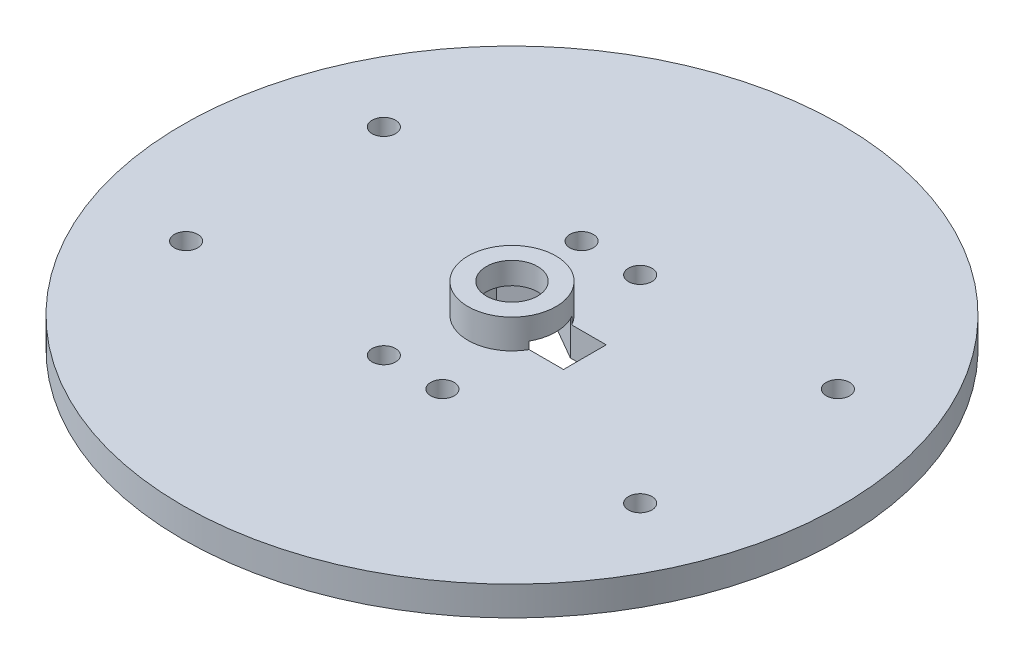
ISO-10303-21;
HEADER;
FILE_DESCRIPTION(('STEP AP214'),'2;1');
FILE_NAME('part.step','',(''),(''),'','','');
FILE_SCHEMA(('AUTOMOTIVE_DESIGN { 1 0 10303 214 1 1 1 1 }'));
ENDSEC;
DATA;
#1=APPLICATION_CONTEXT('core data for automotive mechanical design processes');
#2=APPLICATION_PROTOCOL_DEFINITION('international standard','automotive_design',2000,#1);
#3=PRODUCT_CONTEXT('',#1,'mechanical');
#4=PRODUCT('Part','Part','',(#3));
#5=PRODUCT_RELATED_PRODUCT_CATEGORY('part','',(#4));
#6=PRODUCT_DEFINITION_FORMATION('','',#4);
#7=PRODUCT_DEFINITION_CONTEXT('part definition',#1,'design');
#8=PRODUCT_DEFINITION('design','',#6,#7);
#9=PRODUCT_DEFINITION_SHAPE('','',#8);
#10=(LENGTH_UNIT() NAMED_UNIT(*) SI_UNIT(.MILLI.,.METRE.));
#11=(NAMED_UNIT(*) PLANE_ANGLE_UNIT() SI_UNIT($,.RADIAN.));
#12=(NAMED_UNIT(*) SI_UNIT($,.STERADIAN.) SOLID_ANGLE_UNIT());
#13=UNCERTAINTY_MEASURE_WITH_UNIT(LENGTH_MEASURE(1.E-05),#10,'distance_accuracy_value','');
#14=(GEOMETRIC_REPRESENTATION_CONTEXT(3) GLOBAL_UNCERTAINTY_ASSIGNED_CONTEXT((#13)) GLOBAL_UNIT_ASSIGNED_CONTEXT((#10,
#11,#12)) REPRESENTATION_CONTEXT('',''));
#15=CARTESIAN_POINT('',(0.,0.,0.));
#16=DIRECTION('',(0.,0.,1.));
#17=DIRECTION('',(1.,0.,0.));
#18=AXIS2_PLACEMENT_3D('',#15,#16,#17);
#19=CARTESIAN_POINT('',(0.,4.,0.));
#20=DIRECTION('',(0.,-1.,0.));
#21=DIRECTION('',(0.,0.,-1.));
#22=AXIS2_PLACEMENT_3D('',#19,#20,#21);
#23=CYLINDRICAL_SURFACE('',#22,45.);
#24=CARTESIAN_POINT('',(0.,4.,0.));
#25=DIRECTION('',(0.,1.,0.));
#26=DIRECTION('',(0.,0.,1.));
#27=AXIS2_PLACEMENT_3D('',#24,#25,#26);
#28=CIRCLE('',#27,45.);
#29=CARTESIAN_POINT('',(0.,4.,45.));
#30=VERTEX_POINT('',#29);
#31=EDGE_CURVE('E271',#30,#30,#28,.T.);
#32=ORIENTED_EDGE('',*,*,#31,.F.);
#33=EDGE_LOOP('',(#32));
#34=FACE_BOUND('',#33,.T.);
#35=CARTESIAN_POINT('',(0.,0.,0.));
#36=DIRECTION('',(0.,1.,0.));
#37=DIRECTION('',(0.,0.,1.));
#38=AXIS2_PLACEMENT_3D('',#35,#36,#37);
#39=CIRCLE('',#38,45.);
#40=CARTESIAN_POINT('',(0.,0.,45.));
#41=VERTEX_POINT('',#40);
#42=EDGE_CURVE('E267',#41,#41,#39,.T.);
#43=ORIENTED_EDGE('',*,*,#42,.T.);
#44=EDGE_LOOP('',(#43));
#45=FACE_BOUND('',#44,.T.);
#46=ADVANCED_FACE('F52',(#34,#45),#23,.T.);
#47=CARTESIAN_POINT('',(0.,4.,0.));
#48=DIRECTION('',(0.,1.,0.));
#49=DIRECTION('',(0.,0.,1.));
#50=AXIS2_PLACEMENT_3D('',#47,#48,#49);
#51=PLANE('',#50);
#52=CARTESIAN_POINT('',(-31.,4.,13.5));
#53=DIRECTION('',(0.,1.,0.));
#54=DIRECTION('',(0.,0.,1.));
#55=AXIS2_PLACEMENT_3D('',#52,#53,#54);
#56=CIRCLE('',#55,1.6);
#57=CARTESIAN_POINT('',(-31.,4.,15.1));
#58=VERTEX_POINT('',#57);
#59=EDGE_CURVE('E563',#58,#58,#56,.T.);
#60=ORIENTED_EDGE('',*,*,#59,.F.);
#61=EDGE_LOOP('',(#60));
#62=FACE_BOUND('',#61,.T.);
#63=CARTESIAN_POINT('',(31.,4.,-13.5));
#64=DIRECTION('',(0.,1.,0.));
#65=DIRECTION('',(0.,0.,1.));
#66=AXIS2_PLACEMENT_3D('',#63,#64,#65);
#67=CIRCLE('',#66,1.6);
#68=CARTESIAN_POINT('',(31.,4.,-11.9));
#69=VERTEX_POINT('',#68);
#70=EDGE_CURVE('E568',#69,#69,#67,.T.);
#71=ORIENTED_EDGE('',*,*,#70,.F.);
#72=EDGE_LOOP('',(#71));
#73=FACE_BOUND('',#72,.T.);
#74=CARTESIAN_POINT('',(31.,4.,13.5));
#75=DIRECTION('',(0.,1.,0.));
#76=DIRECTION('',(0.,0.,1.));
#77=AXIS2_PLACEMENT_3D('',#74,#75,#76);
#78=CIRCLE('',#77,1.6);
#79=CARTESIAN_POINT('',(31.,4.,15.1));
#80=VERTEX_POINT('',#79);
#81=EDGE_CURVE('E574',#80,#80,#78,.T.);
#82=ORIENTED_EDGE('',*,*,#81,.F.);
#83=EDGE_LOOP('',(#82));
#84=FACE_BOUND('',#83,.T.);
#85=CARTESIAN_POINT('',(-31.,4.,-13.5));
#86=DIRECTION('',(0.,1.,0.));
#87=DIRECTION('',(0.,0.,1.));
#88=AXIS2_PLACEMENT_3D('',#85,#86,#87);
#89=CIRCLE('',#88,1.6);
#90=CARTESIAN_POINT('',(-31.,4.,-11.9));
#91=VERTEX_POINT('',#90);
#92=EDGE_CURVE('E578',#91,#91,#89,.T.);
#93=ORIENTED_EDGE('',*,*,#92,.F.);
#94=EDGE_LOOP('',(#93));
#95=FACE_BOUND('',#94,.T.);
#96=DIRECTION('',(1.,0.,0.));
#97=VECTOR('',#96,1.);
#98=CARTESIAN_POINT('',(0.,4.,2.91561885940761));
#99=LINE('',#98,#97);
#100=CARTESIAN_POINT('',(5.24396478503305,4.,2.91561885940761));
#101=VERTEX_POINT('',#100);
#102=CARTESIAN_POINT('',(9.95,4.,2.91561885940761));
#103=VERTEX_POINT('',#102);
#104=EDGE_CURVE('E224',#101,#103,#99,.T.);
#105=ORIENTED_EDGE('',*,*,#104,.F.);
#106=CARTESIAN_POINT('',(0.,4.,0.));
#107=DIRECTION('',(0.,1.,0.));
#108=DIRECTION('',(0.,0.,1.));
#109=AXIS2_PLACEMENT_3D('',#106,#107,#108);
#110=CIRCLE('',#109,6.);
#111=CARTESIAN_POINT('',(5.24396478503305,4.,-2.91561885940761));
#112=VERTEX_POINT('',#111);
#113=EDGE_CURVE('E259',#112,#101,#110,.T.);
#114=ORIENTED_EDGE('',*,*,#113,.F.);
#115=DIRECTION('',(-1.,0.,0.));
#116=VECTOR('',#115,1.);
#117=CARTESIAN_POINT('',(0.,4.,-2.9156188594076));
#118=LINE('',#117,#116);
#119=CARTESIAN_POINT('',(9.95,4.,-2.91561885940761));
#120=VERTEX_POINT('',#119);
#121=EDGE_CURVE('E204',#120,#112,#118,.T.);
#122=ORIENTED_EDGE('',*,*,#121,.F.);
#123=DIRECTION('',(0.,0.,-1.));
#124=VECTOR('',#123,1.);
#125=CARTESIAN_POINT('',(9.95,4.,0.));
#126=LINE('',#125,#124);
#127=EDGE_CURVE('E227',#103,#120,#126,.T.);
#128=ORIENTED_EDGE('',*,*,#127,.F.);
#129=EDGE_LOOP('',(#105,#114,#122,#128));
#130=FACE_BOUND('',#129,.T.);
#131=CARTESIAN_POINT('',(4.,4.,-13.5));
#132=DIRECTION('',(0.,1.,0.));
#133=DIRECTION('',(0.,0.,1.));
#134=AXIS2_PLACEMENT_3D('',#131,#132,#133);
#135=CIRCLE('',#134,1.6);
#136=CARTESIAN_POINT('',(4.,4.,-11.9));
#137=VERTEX_POINT('',#136);
#138=EDGE_CURVE('E230',#137,#137,#135,.T.);
#139=ORIENTED_EDGE('',*,*,#138,.F.);
#140=EDGE_LOOP('',(#139));
#141=FACE_BOUND('',#140,.T.);
#142=CARTESIAN_POINT('',(4.,4.,13.5));
#143=DIRECTION('',(0.,1.,0.));
#144=DIRECTION('',(0.,0.,1.));
#145=AXIS2_PLACEMENT_3D('',#142,#143,#144);
#146=CIRCLE('',#145,1.6);
#147=CARTESIAN_POINT('',(4.,4.,15.1));
#148=VERTEX_POINT('',#147);
#149=EDGE_CURVE('E244',#148,#148,#146,.T.);
#150=ORIENTED_EDGE('',*,*,#149,.F.);
#151=EDGE_LOOP('',(#150));
#152=FACE_BOUND('',#151,.T.);
#153=CARTESIAN_POINT('',(-4.,4.,13.5));
#154=DIRECTION('',(0.,1.,0.));
#155=DIRECTION('',(0.,0.,1.));
#156=AXIS2_PLACEMENT_3D('',#153,#154,#155);
#157=CIRCLE('',#156,1.6);
#158=CARTESIAN_POINT('',(-4.,4.,15.1));
#159=VERTEX_POINT('',#158);
#160=EDGE_CURVE('E236',#159,#159,#157,.T.);
#161=ORIENTED_EDGE('',*,*,#160,.F.);
#162=EDGE_LOOP('',(#161));
#163=FACE_BOUND('',#162,.T.);
#164=CARTESIAN_POINT('',(-4.,4.,-13.5));
#165=DIRECTION('',(0.,1.,0.));
#166=DIRECTION('',(0.,0.,1.));
#167=AXIS2_PLACEMENT_3D('',#164,#165,#166);
#168=CIRCLE('',#167,1.6);
#169=CARTESIAN_POINT('',(-4.,4.,-11.9));
#170=VERTEX_POINT('',#169);
#171=EDGE_CURVE('E235',#170,#170,#168,.T.);
#172=ORIENTED_EDGE('',*,*,#171,.F.);
#173=EDGE_LOOP('',(#172));
#174=FACE_BOUND('',#173,.T.);
#175=ORIENTED_EDGE('',*,*,#31,.T.);
#176=EDGE_LOOP('',(#175));
#177=FACE_BOUND('',#176,.T.);
#178=ADVANCED_FACE('F289',(#62,#73,#84,#95,#130,#141,#152,#163,#174,#177),#51,.T.);
#179=CARTESIAN_POINT('',(0.,0.,0.));
#180=DIRECTION('',(0.,1.,0.));
#181=DIRECTION('',(0.,0.,1.));
#182=AXIS2_PLACEMENT_3D('',#179,#180,#181);
#183=PLANE('',#182);
#184=CARTESIAN_POINT('',(-31.,0.,13.5));
#185=DIRECTION('',(0.,-1.,0.));
#186=DIRECTION('',(0.,0.,1.));
#187=AXIS2_PLACEMENT_3D('',#184,#185,#186);
#188=CIRCLE('',#187,1.6);
#189=CARTESIAN_POINT('',(-31.,0.,15.1));
#190=VERTEX_POINT('',#189);
#191=EDGE_CURVE('E587',#190,#190,#188,.T.);
#192=ORIENTED_EDGE('',*,*,#191,.F.);
#193=EDGE_LOOP('',(#192));
#194=FACE_BOUND('',#193,.T.);
#195=CARTESIAN_POINT('',(31.,0.,-13.5));
#196=DIRECTION('',(0.,-1.,0.));
#197=DIRECTION('',(0.,0.,-1.));
#198=AXIS2_PLACEMENT_3D('',#195,#196,#197);
#199=CIRCLE('',#198,1.6);
#200=CARTESIAN_POINT('',(31.,0.,-15.1));
#201=VERTEX_POINT('',#200);
#202=EDGE_CURVE('E586',#201,#201,#199,.T.);
#203=ORIENTED_EDGE('',*,*,#202,.F.);
#204=EDGE_LOOP('',(#203));
#205=FACE_BOUND('',#204,.T.);
#206=CARTESIAN_POINT('',(31.,0.,13.5));
#207=DIRECTION('',(0.,-1.,0.));
#208=DIRECTION('',(0.,0.,-1.));
#209=AXIS2_PLACEMENT_3D('',#206,#207,#208);
#210=CIRCLE('',#209,1.6);
#211=CARTESIAN_POINT('',(31.,0.,11.9));
#212=VERTEX_POINT('',#211);
#213=EDGE_CURVE('E582',#212,#212,#210,.T.);
#214=ORIENTED_EDGE('',*,*,#213,.F.);
#215=EDGE_LOOP('',(#214));
#216=FACE_BOUND('',#215,.T.);
#217=CARTESIAN_POINT('',(-31.,0.,-13.5));
#218=DIRECTION('',(0.,-1.,0.));
#219=DIRECTION('',(0.,0.,1.));
#220=AXIS2_PLACEMENT_3D('',#217,#218,#219);
#221=CIRCLE('',#220,1.6);
#222=CARTESIAN_POINT('',(-31.,0.,-11.9));
#223=VERTEX_POINT('',#222);
#224=EDGE_CURVE('E591',#223,#223,#221,.T.);
#225=ORIENTED_EDGE('',*,*,#224,.F.);
#226=EDGE_LOOP('',(#225));
#227=FACE_BOUND('',#226,.T.);
#228=DIRECTION('',(-0.866025403784439,0.,0.5));
#229=VECTOR('',#228,1.);
#230=CARTESIAN_POINT('',(5.05,0.,2.91561885940761));
#231=LINE('',#230,#229);
#232=CARTESIAN_POINT('',(5.05,0.,2.91561885940761));
#233=VERTEX_POINT('',#232);
#234=CARTESIAN_POINT('',(0.,0.,5.83123771881522));
#235=VERTEX_POINT('',#234);
#236=EDGE_CURVE('E174',#233,#235,#231,.T.);
#237=ORIENTED_EDGE('',*,*,#236,.F.);
#238=DIRECTION('',(-1.,0.,0.));
#239=VECTOR('',#238,1.);
#240=CARTESIAN_POINT('',(9.95,0.,2.91561885940761));
#241=LINE('',#240,#239);
#242=CARTESIAN_POINT('',(9.95,0.,2.91561885940761));
#243=VERTEX_POINT('',#242);
#244=EDGE_CURVE('E67',#243,#233,#241,.T.);
#245=ORIENTED_EDGE('',*,*,#244,.F.);
#246=DIRECTION('',(0.,0.,1.));
#247=VECTOR('',#246,1.);
#248=CARTESIAN_POINT('',(9.95,0.,2.91561885940761));
#249=LINE('',#248,#247);
#250=CARTESIAN_POINT('',(9.95,0.,-2.91561885940761));
#251=VERTEX_POINT('',#250);
#252=EDGE_CURVE('E138',#251,#243,#249,.T.);
#253=ORIENTED_EDGE('',*,*,#252,.F.);
#254=DIRECTION('',(1.,0.,0.));
#255=VECTOR('',#254,1.);
#256=CARTESIAN_POINT('',(9.95,0.,-2.91561885940761));
#257=LINE('',#256,#255);
#258=CARTESIAN_POINT('',(5.05,0.,-2.91561885940761));
#259=VERTEX_POINT('',#258);
#260=EDGE_CURVE('E194',#259,#251,#257,.T.);
#261=ORIENTED_EDGE('',*,*,#260,.F.);
#262=DIRECTION('',(0.866025403784438,0.,0.5));
#263=VECTOR('',#262,1.);
#264=CARTESIAN_POINT('',(0.,0.,-5.83123771881522));
#265=LINE('',#264,#263);
#266=CARTESIAN_POINT('',(0.,0.,-5.83123771881522));
#267=VERTEX_POINT('',#266);
#268=EDGE_CURVE('E190',#267,#259,#265,.T.);
#269=ORIENTED_EDGE('',*,*,#268,.F.);
#270=DIRECTION('',(0.866025403784439,0.,-0.5));
#271=VECTOR('',#270,1.);
#272=CARTESIAN_POINT('',(-5.05,0.,-2.91561885940761));
#273=LINE('',#272,#271);
#274=CARTESIAN_POINT('',(-5.05,0.,-2.91561885940761));
#275=VERTEX_POINT('',#274);
#276=EDGE_CURVE('E186',#275,#267,#273,.T.);
#277=ORIENTED_EDGE('',*,*,#276,.F.);
#278=DIRECTION('',(0.,0.,-1.));
#279=VECTOR('',#278,1.);
#280=CARTESIAN_POINT('',(-5.05,0.,2.91561885940761));
#281=LINE('',#280,#279);
#282=CARTESIAN_POINT('',(-5.05,0.,2.91561885940761));
#283=VERTEX_POINT('',#282);
#284=EDGE_CURVE('E182',#283,#275,#281,.T.);
#285=ORIENTED_EDGE('',*,*,#284,.F.);
#286=DIRECTION('',(-0.866025403784439,0.,-0.5));
#287=VECTOR('',#286,1.);
#288=CARTESIAN_POINT('',(0.,0.,5.83123771881522));
#289=LINE('',#288,#287);
#290=EDGE_CURVE('E178',#235,#283,#289,.T.);
#291=ORIENTED_EDGE('',*,*,#290,.F.);
#292=EDGE_LOOP('',(#237,#245,#253,#261,#269,#277,#285,#291));
#293=FACE_BOUND('',#292,.T.);
#294=CARTESIAN_POINT('',(4.,0.,-13.5));
#295=DIRECTION('',(0.,1.,0.));
#296=DIRECTION('',(0.,0.,1.));
#297=AXIS2_PLACEMENT_3D('',#294,#295,#296);
#298=CIRCLE('',#297,1.6);
#299=CARTESIAN_POINT('',(4.,0.,-11.9));
#300=VERTEX_POINT('',#299);
#301=EDGE_CURVE('E248',#300,#300,#298,.T.);
#302=ORIENTED_EDGE('',*,*,#301,.T.);
#303=EDGE_LOOP('',(#302));
#304=FACE_BOUND('',#303,.T.);
#305=CARTESIAN_POINT('',(4.,0.,13.5));
#306=DIRECTION('',(0.,1.,0.));
#307=DIRECTION('',(0.,0.,1.));
#308=AXIS2_PLACEMENT_3D('',#305,#306,#307);
#309=CIRCLE('',#308,1.6);
#310=CARTESIAN_POINT('',(4.,0.,15.1));
#311=VERTEX_POINT('',#310);
#312=EDGE_CURVE('E240',#311,#311,#309,.T.);
#313=ORIENTED_EDGE('',*,*,#312,.T.);
#314=EDGE_LOOP('',(#313));
#315=FACE_BOUND('',#314,.T.);
#316=CARTESIAN_POINT('',(-4.,0.,13.5));
#317=DIRECTION('',(0.,1.,0.));
#318=DIRECTION('',(0.,0.,1.));
#319=AXIS2_PLACEMENT_3D('',#316,#317,#318);
#320=CIRCLE('',#319,1.6);
#321=CARTESIAN_POINT('',(-4.,0.,15.1));
#322=VERTEX_POINT('',#321);
#323=EDGE_CURVE('E231',#322,#322,#320,.T.);
#324=ORIENTED_EDGE('',*,*,#323,.T.);
#325=EDGE_LOOP('',(#324));
#326=FACE_BOUND('',#325,.T.);
#327=CARTESIAN_POINT('',(-4.,0.,-13.5));
#328=DIRECTION('',(0.,1.,0.));
#329=DIRECTION('',(0.,0.,1.));
#330=AXIS2_PLACEMENT_3D('',#327,#328,#329);
#331=CIRCLE('',#330,1.6);
#332=CARTESIAN_POINT('',(-4.,0.,-11.9));
#333=VERTEX_POINT('',#332);
#334=EDGE_CURVE('E255',#333,#333,#331,.T.);
#335=ORIENTED_EDGE('',*,*,#334,.T.);
#336=EDGE_LOOP('',(#335));
#337=FACE_BOUND('',#336,.T.);
#338=ORIENTED_EDGE('',*,*,#42,.F.);
#339=EDGE_LOOP('',(#338));
#340=FACE_BOUND('',#339,.T.);
#341=ADVANCED_FACE('F299',(#194,#205,#216,#227,#293,#304,#315,#326,#337,#340),#183,.F.);
#342=CARTESIAN_POINT('',(0.,8.,0.));
#343=DIRECTION('',(0.,-1.,0.));
#344=DIRECTION('',(0.,0.,-1.));
#345=AXIS2_PLACEMENT_3D('',#342,#343,#344);
#346=CYLINDRICAL_SURFACE('',#345,6.);
#347=ORIENTED_EDGE('',*,*,#113,.T.);
#348=DIRECTION('',(0.,-1.,0.));
#349=VECTOR('',#348,1.);
#350=CARTESIAN_POINT('',(5.24396478503305,8.,2.91561885940761));
#351=LINE('',#350,#349);
#352=CARTESIAN_POINT('',(5.24396478503305,5.,2.91561885940761));
#353=VERTEX_POINT('',#352);
#354=EDGE_CURVE('E13',#101,#353,#351,.F.);
#355=ORIENTED_EDGE('',*,*,#354,.T.);
#356=CARTESIAN_POINT('',(0.,5.,0.));
#357=DIRECTION('',(0.,-1.,0.));
#358=DIRECTION('',(0.,0.,-1.));
#359=AXIS2_PLACEMENT_3D('',#356,#357,#358);
#360=CIRCLE('',#359,6.);
#361=CARTESIAN_POINT('',(5.24396478503305,5.,-2.91561885940761));
#362=VERTEX_POINT('',#361);
#363=EDGE_CURVE('E136',#362,#353,#360,.T.);
#364=ORIENTED_EDGE('',*,*,#363,.F.);
#365=DIRECTION('',(0.,-1.,0.));
#366=VECTOR('',#365,1.);
#367=CARTESIAN_POINT('',(5.24396478503305,8.,-2.91561885940761));
#368=LINE('',#367,#366);
#369=EDGE_CURVE('E60',#362,#112,#368,.T.);
#370=ORIENTED_EDGE('',*,*,#369,.T.);
#371=EDGE_LOOP('',(#347,#355,#364,#370));
#372=FACE_BOUND('',#371,.T.);
#373=CARTESIAN_POINT('',(0.,8.,0.));
#374=DIRECTION('',(0.,1.,0.));
#375=DIRECTION('',(0.,0.,1.));
#376=AXIS2_PLACEMENT_3D('',#373,#374,#375);
#377=CIRCLE('',#376,6.);
#378=CARTESIAN_POINT('',(0.,8.,6.));
#379=VERTEX_POINT('',#378);
#380=EDGE_CURVE('E263',#379,#379,#377,.T.);
#381=ORIENTED_EDGE('',*,*,#380,.F.);
#382=EDGE_LOOP('',(#381));
#383=FACE_BOUND('',#382,.T.);
#384=ADVANCED_FACE('F283',(#372,#383),#346,.T.);
#385=CARTESIAN_POINT('',(0.,8.,0.));
#386=DIRECTION('',(0.,1.,0.));
#387=DIRECTION('',(0.,0.,1.));
#388=AXIS2_PLACEMENT_3D('',#385,#386,#387);
#389=PLANE('',#388);
#390=CARTESIAN_POINT('',(0.,8.,0.));
#391=DIRECTION('',(0.,1.,0.));
#392=DIRECTION('',(0.,0.,1.));
#393=AXIS2_PLACEMENT_3D('',#390,#391,#392);
#394=CIRCLE('',#393,3.5);
#395=CARTESIAN_POINT('',(0.,8.,3.5));
#396=VERTEX_POINT('',#395);
#397=EDGE_CURVE('E175',#396,#396,#394,.T.);
#398=ORIENTED_EDGE('',*,*,#397,.F.);
#399=EDGE_LOOP('',(#398));
#400=FACE_BOUND('',#399,.T.);
#401=ORIENTED_EDGE('',*,*,#380,.T.);
#402=EDGE_LOOP('',(#401));
#403=FACE_BOUND('',#402,.T.);
#404=ADVANCED_FACE('F341',(#400,#403),#389,.T.);
#405=CARTESIAN_POINT('',(-4.,0.,-13.5));
#406=DIRECTION('',(0.,1.,0.));
#407=DIRECTION('',(0.,0.,1.));
#408=AXIS2_PLACEMENT_3D('',#405,#406,#407);
#409=CYLINDRICAL_SURFACE('',#408,1.6);
#410=ORIENTED_EDGE('',*,*,#334,.F.);
#411=EDGE_LOOP('',(#410));
#412=FACE_BOUND('',#411,.T.);
#413=ORIENTED_EDGE('',*,*,#171,.T.);
#414=EDGE_LOOP('',(#413));
#415=FACE_BOUND('',#414,.T.);
#416=ADVANCED_FACE('F348',(#412,#415),#409,.F.);
#417=CARTESIAN_POINT('',(-4.,0.,13.5));
#418=DIRECTION('',(0.,1.,0.));
#419=DIRECTION('',(0.,0.,1.));
#420=AXIS2_PLACEMENT_3D('',#417,#418,#419);
#421=CYLINDRICAL_SURFACE('',#420,1.6);
#422=ORIENTED_EDGE('',*,*,#323,.F.);
#423=EDGE_LOOP('',(#422));
#424=FACE_BOUND('',#423,.T.);
#425=ORIENTED_EDGE('',*,*,#160,.T.);
#426=EDGE_LOOP('',(#425));
#427=FACE_BOUND('',#426,.T.);
#428=ADVANCED_FACE('F352',(#424,#427),#421,.F.);
#429=CARTESIAN_POINT('',(4.,0.,13.5));
#430=DIRECTION('',(0.,1.,0.));
#431=DIRECTION('',(0.,0.,1.));
#432=AXIS2_PLACEMENT_3D('',#429,#430,#431);
#433=CYLINDRICAL_SURFACE('',#432,1.6);
#434=ORIENTED_EDGE('',*,*,#312,.F.);
#435=EDGE_LOOP('',(#434));
#436=FACE_BOUND('',#435,.T.);
#437=ORIENTED_EDGE('',*,*,#149,.T.);
#438=EDGE_LOOP('',(#437));
#439=FACE_BOUND('',#438,.T.);
#440=ADVANCED_FACE('F357',(#436,#439),#433,.F.);
#441=CARTESIAN_POINT('',(4.,0.,-13.5));
#442=DIRECTION('',(0.,1.,0.));
#443=DIRECTION('',(0.,0.,1.));
#444=AXIS2_PLACEMENT_3D('',#441,#442,#443);
#445=CYLINDRICAL_SURFACE('',#444,1.6);
#446=ORIENTED_EDGE('',*,*,#301,.F.);
#447=EDGE_LOOP('',(#446));
#448=FACE_BOUND('',#447,.T.);
#449=ORIENTED_EDGE('',*,*,#138,.T.);
#450=EDGE_LOOP('',(#449));
#451=FACE_BOUND('',#450,.T.);
#452=ADVANCED_FACE('F354',(#448,#451),#445,.F.);
#453=CARTESIAN_POINT('',(0.,5.,0.));
#454=DIRECTION('',(0.,-1.,0.));
#455=DIRECTION('',(0.,0.,-1.));
#456=AXIS2_PLACEMENT_3D('',#453,#454,#455);
#457=PLANE('',#456);
#458=CARTESIAN_POINT('',(0.,5.,0.));
#459=DIRECTION('',(0.,-1.,0.));
#460=DIRECTION('',(0.,0.,-1.));
#461=AXIS2_PLACEMENT_3D('',#458,#459,#460);
#462=CIRCLE('',#461,3.5);
#463=CARTESIAN_POINT('',(0.,5.,-3.5));
#464=VERTEX_POINT('',#463);
#465=EDGE_CURVE('E560',#464,#464,#462,.T.);
#466=ORIENTED_EDGE('',*,*,#465,.F.);
#467=EDGE_LOOP('',(#466));
#468=FACE_BOUND('',#467,.T.);
#469=ORIENTED_EDGE('',*,*,#363,.T.);
#470=DIRECTION('',(-1.,0.,0.));
#471=VECTOR('',#470,1.);
#472=CARTESIAN_POINT('',(9.95,5.,2.91561885940761));
#473=LINE('',#472,#471);
#474=CARTESIAN_POINT('',(5.05,5.,2.91561885940761));
#475=VERTEX_POINT('',#474);
#476=EDGE_CURVE('E130',#353,#475,#473,.T.);
#477=ORIENTED_EDGE('',*,*,#476,.T.);
#478=DIRECTION('',(-0.866025403784439,0.,0.5));
#479=VECTOR('',#478,1.);
#480=CARTESIAN_POINT('',(5.05,5.,2.91561885940761));
#481=LINE('',#480,#479);
#482=CARTESIAN_POINT('',(0.,5.,5.83123771881522));
#483=VERTEX_POINT('',#482);
#484=EDGE_CURVE('E134',#475,#483,#481,.T.);
#485=ORIENTED_EDGE('',*,*,#484,.T.);
#486=DIRECTION('',(-0.866025403784439,0.,-0.5));
#487=VECTOR('',#486,1.);
#488=CARTESIAN_POINT('',(0.,5.,5.83123771881522));
#489=LINE('',#488,#487);
#490=CARTESIAN_POINT('',(-5.05,5.,2.91561885940761));
#491=VERTEX_POINT('',#490);
#492=EDGE_CURVE('E151',#483,#491,#489,.T.);
#493=ORIENTED_EDGE('',*,*,#492,.T.);
#494=DIRECTION('',(0.,0.,-1.));
#495=VECTOR('',#494,1.);
#496=CARTESIAN_POINT('',(-5.05,5.,2.91561885940761));
#497=LINE('',#496,#495);
#498=CARTESIAN_POINT('',(-5.05,5.,-2.91561885940761));
#499=VERTEX_POINT('',#498);
#500=EDGE_CURVE('E156',#491,#499,#497,.T.);
#501=ORIENTED_EDGE('',*,*,#500,.T.);
#502=DIRECTION('',(0.866025403784439,0.,-0.5));
#503=VECTOR('',#502,1.);
#504=CARTESIAN_POINT('',(-5.05,5.,-2.91561885940761));
#505=LINE('',#504,#503);
#506=CARTESIAN_POINT('',(0.,5.,-5.83123771881522));
#507=VERTEX_POINT('',#506);
#508=EDGE_CURVE('E163',#499,#507,#505,.T.);
#509=ORIENTED_EDGE('',*,*,#508,.T.);
#510=DIRECTION('',(0.866025403784438,0.,0.5));
#511=VECTOR('',#510,1.);
#512=CARTESIAN_POINT('',(0.,5.,-5.83123771881522));
#513=LINE('',#512,#511);
#514=CARTESIAN_POINT('',(5.05,5.,-2.91561885940761));
#515=VERTEX_POINT('',#514);
#516=EDGE_CURVE('E167',#507,#515,#513,.T.);
#517=ORIENTED_EDGE('',*,*,#516,.T.);
#518=DIRECTION('',(1.,0.,0.));
#519=VECTOR('',#518,1.);
#520=CARTESIAN_POINT('',(9.95,5.,-2.91561885940761));
#521=LINE('',#520,#519);
#522=EDGE_CURVE('E75',#515,#362,#521,.T.);
#523=ORIENTED_EDGE('',*,*,#522,.T.);
#524=EDGE_LOOP('',(#469,#477,#485,#493,#501,#509,#517,#523));
#525=FACE_BOUND('',#524,.T.);
#526=ADVANCED_FACE('F131',(#468,#525),#457,.T.);
#527=CARTESIAN_POINT('',(9.95,5.,2.91561885940761));
#528=DIRECTION('',(0.,0.,1.));
#529=DIRECTION('',(1.,0.,0.));
#530=AXIS2_PLACEMENT_3D('',#527,#528,#529);
#531=PLANE('',#530);
#532=ORIENTED_EDGE('',*,*,#104,.T.);
#533=DIRECTION('',(0.,-1.,0.));
#534=VECTOR('',#533,1.);
#535=CARTESIAN_POINT('',(9.95,5.,2.91561885940761));
#536=LINE('',#535,#534);
#537=EDGE_CURVE('E201',#103,#243,#536,.T.);
#538=ORIENTED_EDGE('',*,*,#537,.T.);
#539=ORIENTED_EDGE('',*,*,#244,.T.);
#540=DIRECTION('',(0.,-1.,0.));
#541=VECTOR('',#540,1.);
#542=CARTESIAN_POINT('',(5.05,5.,2.91561885940761));
#543=LINE('',#542,#541);
#544=EDGE_CURVE('E140',#475,#233,#543,.T.);
#545=ORIENTED_EDGE('',*,*,#544,.F.);
#546=ORIENTED_EDGE('',*,*,#476,.F.);
#547=ORIENTED_EDGE('',*,*,#354,.F.);
#548=EDGE_LOOP('',(#532,#538,#539,#545,#546,#547));
#549=FACE_BOUND('',#548,.T.);
#550=ADVANCED_FACE('F141',(#549),#531,.F.);
#551=CARTESIAN_POINT('',(9.95,5.,2.91561885940761));
#552=DIRECTION('',(1.,0.,0.));
#553=DIRECTION('',(0.,0.,-1.));
#554=AXIS2_PLACEMENT_3D('',#551,#552,#553);
#555=PLANE('',#554);
#556=ORIENTED_EDGE('',*,*,#127,.T.);
#557=DIRECTION('',(0.,-1.,0.));
#558=VECTOR('',#557,1.);
#559=CARTESIAN_POINT('',(9.95,5.,-2.91561885940761));
#560=LINE('',#559,#558);
#561=EDGE_CURVE('E205',#120,#251,#560,.T.);
#562=ORIENTED_EDGE('',*,*,#561,.T.);
#563=ORIENTED_EDGE('',*,*,#252,.T.);
#564=ORIENTED_EDGE('',*,*,#537,.F.);
#565=EDGE_LOOP('',(#556,#562,#563,#564));
#566=FACE_BOUND('',#565,.T.);
#567=ADVANCED_FACE('F294',(#566),#555,.F.);
#568=CARTESIAN_POINT('',(9.95,5.,-2.91561885940761));
#569=DIRECTION('',(0.,0.,-1.));
#570=DIRECTION('',(-1.,0.,0.));
#571=AXIS2_PLACEMENT_3D('',#568,#569,#570);
#572=PLANE('',#571);
#573=ORIENTED_EDGE('',*,*,#121,.T.);
#574=ORIENTED_EDGE('',*,*,#369,.F.);
#575=ORIENTED_EDGE('',*,*,#522,.F.);
#576=DIRECTION('',(0.,-1.,0.));
#577=VECTOR('',#576,1.);
#578=CARTESIAN_POINT('',(5.05,5.,-2.91561885940761));
#579=LINE('',#578,#577);
#580=EDGE_CURVE('E208',#515,#259,#579,.T.);
#581=ORIENTED_EDGE('',*,*,#580,.T.);
#582=ORIENTED_EDGE('',*,*,#260,.T.);
#583=ORIENTED_EDGE('',*,*,#561,.F.);
#584=EDGE_LOOP('',(#573,#574,#575,#581,#582,#583));
#585=FACE_BOUND('',#584,.T.);
#586=ADVANCED_FACE('F316',(#585),#572,.F.);
#587=CARTESIAN_POINT('',(0.,5.,-5.83123771881522));
#588=DIRECTION('',(0.5,0.,-0.866025403784438));
#589=DIRECTION('',(-0.866025403784438,0.,-0.5));
#590=AXIS2_PLACEMENT_3D('',#587,#588,#589);
#591=PLANE('',#590);
#592=ORIENTED_EDGE('',*,*,#268,.T.);
#593=ORIENTED_EDGE('',*,*,#580,.F.);
#594=ORIENTED_EDGE('',*,*,#516,.F.);
#595=DIRECTION('',(0.,-1.,0.));
#596=VECTOR('',#595,1.);
#597=CARTESIAN_POINT('',(0.,5.,-5.83123771881522));
#598=LINE('',#597,#596);
#599=EDGE_CURVE('E211',#507,#267,#598,.T.);
#600=ORIENTED_EDGE('',*,*,#599,.T.);
#601=EDGE_LOOP('',(#592,#593,#594,#600));
#602=FACE_BOUND('',#601,.T.);
#603=ADVANCED_FACE('F315',(#602),#591,.F.);
#604=CARTESIAN_POINT('',(-5.05,5.,-2.91561885940761));
#605=DIRECTION('',(-0.5,0.,-0.866025403784439));
#606=DIRECTION('',(-0.866025403784439,0.,0.5));
#607=AXIS2_PLACEMENT_3D('',#604,#605,#606);
#608=PLANE('',#607);
#609=ORIENTED_EDGE('',*,*,#276,.T.);
#610=ORIENTED_EDGE('',*,*,#599,.F.);
#611=ORIENTED_EDGE('',*,*,#508,.F.);
#612=DIRECTION('',(0.,-1.,0.));
#613=VECTOR('',#612,1.);
#614=CARTESIAN_POINT('',(-5.05,5.,-2.91561885940761));
#615=LINE('',#614,#613);
#616=EDGE_CURVE('E214',#499,#275,#615,.T.);
#617=ORIENTED_EDGE('',*,*,#616,.T.);
#618=EDGE_LOOP('',(#609,#610,#611,#617));
#619=FACE_BOUND('',#618,.T.);
#620=ADVANCED_FACE('F311',(#619),#608,.F.);
#621=CARTESIAN_POINT('',(-5.05,5.,2.91561885940761));
#622=DIRECTION('',(-1.,0.,0.));
#623=DIRECTION('',(0.,0.,1.));
#624=AXIS2_PLACEMENT_3D('',#621,#622,#623);
#625=PLANE('',#624);
#626=ORIENTED_EDGE('',*,*,#284,.T.);
#627=ORIENTED_EDGE('',*,*,#616,.F.);
#628=ORIENTED_EDGE('',*,*,#500,.F.);
#629=DIRECTION('',(0.,-1.,0.));
#630=VECTOR('',#629,1.);
#631=CARTESIAN_POINT('',(-5.05,5.,2.91561885940761));
#632=LINE('',#631,#630);
#633=EDGE_CURVE('E217',#491,#283,#632,.T.);
#634=ORIENTED_EDGE('',*,*,#633,.T.);
#635=EDGE_LOOP('',(#626,#627,#628,#634));
#636=FACE_BOUND('',#635,.T.);
#637=ADVANCED_FACE('F309',(#636),#625,.F.);
#638=CARTESIAN_POINT('',(0.,5.,5.83123771881522));
#639=DIRECTION('',(-0.5,0.,0.866025403784438));
#640=DIRECTION('',(0.866025403784438,0.,0.5));
#641=AXIS2_PLACEMENT_3D('',#638,#639,#640);
#642=PLANE('',#641);
#643=ORIENTED_EDGE('',*,*,#290,.T.);
#644=ORIENTED_EDGE('',*,*,#633,.F.);
#645=ORIENTED_EDGE('',*,*,#492,.F.);
#646=DIRECTION('',(0.,-1.,0.));
#647=VECTOR('',#646,1.);
#648=CARTESIAN_POINT('',(0.,5.,5.83123771881522));
#649=LINE('',#648,#647);
#650=EDGE_CURVE('E146',#483,#235,#649,.T.);
#651=ORIENTED_EDGE('',*,*,#650,.T.);
#652=EDGE_LOOP('',(#643,#644,#645,#651));
#653=FACE_BOUND('',#652,.T.);
#654=ADVANCED_FACE('F305',(#653),#642,.F.);
#655=CARTESIAN_POINT('',(5.05,5.,2.91561885940761));
#656=DIRECTION('',(0.5,0.,0.866025403784439));
#657=DIRECTION('',(0.866025403784439,0.,-0.5));
#658=AXIS2_PLACEMENT_3D('',#655,#656,#657);
#659=PLANE('',#658);
#660=ORIENTED_EDGE('',*,*,#236,.T.);
#661=ORIENTED_EDGE('',*,*,#650,.F.);
#662=ORIENTED_EDGE('',*,*,#484,.F.);
#663=ORIENTED_EDGE('',*,*,#544,.T.);
#664=EDGE_LOOP('',(#660,#661,#662,#663));
#665=FACE_BOUND('',#664,.T.);
#666=ADVANCED_FACE('F148',(#665),#659,.F.);
#667=CARTESIAN_POINT('',(0.,10.,0.));
#668=DIRECTION('',(0.,-1.,0.));
#669=DIRECTION('',(0.,0.,-1.));
#670=AXIS2_PLACEMENT_3D('',#667,#668,#669);
#671=CYLINDRICAL_SURFACE('',#670,3.5);
#672=ORIENTED_EDGE('',*,*,#397,.T.);
#673=EDGE_LOOP('',(#672));
#674=FACE_BOUND('',#673,.T.);
#675=ORIENTED_EDGE('',*,*,#465,.T.);
#676=EDGE_LOOP('',(#675));
#677=FACE_BOUND('',#676,.T.);
#678=ADVANCED_FACE('F369',(#674,#677),#671,.F.);
#679=CARTESIAN_POINT('',(-31.,5.,-13.5));
#680=DIRECTION('',(0.,-1.,0.));
#681=DIRECTION('',(0.,0.,-1.));
#682=AXIS2_PLACEMENT_3D('',#679,#680,#681);
#683=CYLINDRICAL_SURFACE('',#682,1.6);
#684=ORIENTED_EDGE('',*,*,#92,.T.);
#685=EDGE_LOOP('',(#684));
#686=FACE_BOUND('',#685,.T.);
#687=ORIENTED_EDGE('',*,*,#224,.T.);
#688=EDGE_LOOP('',(#687));
#689=FACE_BOUND('',#688,.T.);
#690=ADVANCED_FACE('F393',(#686,#689),#683,.F.);
#691=CARTESIAN_POINT('',(31.,5.,13.5));
#692=DIRECTION('',(0.,-1.,0.));
#693=DIRECTION('',(0.,0.,-1.));
#694=AXIS2_PLACEMENT_3D('',#691,#692,#693);
#695=CYLINDRICAL_SURFACE('',#694,1.6);
#696=ORIENTED_EDGE('',*,*,#81,.T.);
#697=EDGE_LOOP('',(#696));
#698=FACE_BOUND('',#697,.T.);
#699=ORIENTED_EDGE('',*,*,#213,.T.);
#700=EDGE_LOOP('',(#699));
#701=FACE_BOUND('',#700,.T.);
#702=ADVANCED_FACE('F400',(#698,#701),#695,.F.);
#703=CARTESIAN_POINT('',(31.,5.,-13.5));
#704=DIRECTION('',(0.,-1.,0.));
#705=DIRECTION('',(0.,0.,-1.));
#706=AXIS2_PLACEMENT_3D('',#703,#704,#705);
#707=CYLINDRICAL_SURFACE('',#706,1.6);
#708=ORIENTED_EDGE('',*,*,#70,.T.);
#709=EDGE_LOOP('',(#708));
#710=FACE_BOUND('',#709,.T.);
#711=ORIENTED_EDGE('',*,*,#202,.T.);
#712=EDGE_LOOP('',(#711));
#713=FACE_BOUND('',#712,.T.);
#714=ADVANCED_FACE('F407',(#710,#713),#707,.F.);
#715=CARTESIAN_POINT('',(-31.,5.,13.5));
#716=DIRECTION('',(0.,-1.,0.));
#717=DIRECTION('',(0.,0.,-1.));
#718=AXIS2_PLACEMENT_3D('',#715,#716,#717);
#719=CYLINDRICAL_SURFACE('',#718,1.6);
#720=ORIENTED_EDGE('',*,*,#59,.T.);
#721=EDGE_LOOP('',(#720));
#722=FACE_BOUND('',#721,.T.);
#723=ORIENTED_EDGE('',*,*,#191,.T.);
#724=EDGE_LOOP('',(#723));
#725=FACE_BOUND('',#724,.T.);
#726=ADVANCED_FACE('F414',(#722,#725),#719,.F.);
#727=CLOSED_SHELL('',(#46,#178,#341,#384,#404,#416,#428,#440,#452,#526,#550,#567,#586,#603,#620,
#637,#654,#666,#678,#690,#702,#714,#726));
#728=MANIFOLD_SOLID_BREP('B2',#727);
#729=ADVANCED_BREP_SHAPE_REPRESENTATION('',(#18,#728),#14);
#730=SHAPE_DEFINITION_REPRESENTATION(#9,#729);
ENDSEC;
END-ISO-10303-21;
